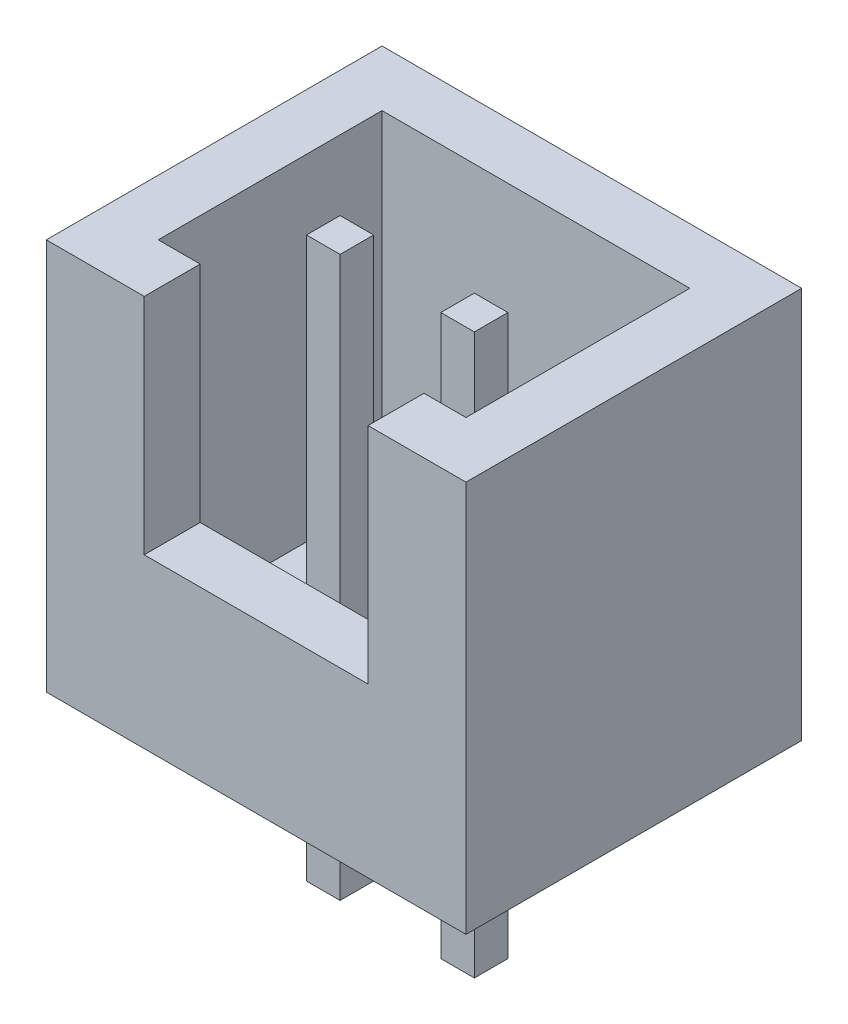
ISO-10303-21;
HEADER;
FILE_DESCRIPTION(('STEP AP214'),'2;1');
FILE_NAME('part.step','',(''),(''),'','','');
FILE_SCHEMA(('AUTOMOTIVE_DESIGN { 1 0 10303 214 1 1 1 1 }'));
ENDSEC;
DATA;
#1=APPLICATION_CONTEXT('core data for automotive mechanical design processes');
#2=APPLICATION_PROTOCOL_DEFINITION('international standard','automotive_design',2000,#1);
#3=PRODUCT_CONTEXT('',#1,'mechanical');
#4=PRODUCT('Part','Part','',(#3));
#5=PRODUCT_RELATED_PRODUCT_CATEGORY('part','',(#4));
#6=PRODUCT_DEFINITION_FORMATION('','',#4);
#7=PRODUCT_DEFINITION_CONTEXT('part definition',#1,'design');
#8=PRODUCT_DEFINITION('design','',#6,#7);
#9=PRODUCT_DEFINITION_SHAPE('','',#8);
#10=(LENGTH_UNIT() NAMED_UNIT(*) SI_UNIT(.MILLI.,.METRE.));
#11=(NAMED_UNIT(*) PLANE_ANGLE_UNIT() SI_UNIT($,.RADIAN.));
#12=(NAMED_UNIT(*) SI_UNIT($,.STERADIAN.) SOLID_ANGLE_UNIT());
#13=UNCERTAINTY_MEASURE_WITH_UNIT(LENGTH_MEASURE(1.E-05),#10,'distance_accuracy_value','');
#14=(GEOMETRIC_REPRESENTATION_CONTEXT(3) GLOBAL_UNCERTAINTY_ASSIGNED_CONTEXT((#13)) GLOBAL_UNIT_ASSIGNED_CONTEXT((#10,
#11,#12)) REPRESENTATION_CONTEXT('',''));
#15=CARTESIAN_POINT('',(0.,0.,0.));
#16=DIRECTION('',(0.,0.,1.));
#17=DIRECTION('',(1.,0.,0.));
#18=AXIS2_PLACEMENT_3D('',#15,#16,#17);
#19=CARTESIAN_POINT('',(3.75,7.,-3.));
#20=DIRECTION('',(-1.,0.,0.));
#21=DIRECTION('',(0.,0.,1.));
#22=AXIS2_PLACEMENT_3D('',#19,#20,#21);
#23=PLANE('',#22);
#24=DIRECTION('',(0.,0.,-1.));
#25=VECTOR('',#24,1.);
#26=CARTESIAN_POINT('',(3.75,0.,-3.));
#27=LINE('',#26,#25);
#28=CARTESIAN_POINT('',(3.75,0.,3.));
#29=VERTEX_POINT('',#28);
#30=CARTESIAN_POINT('',(3.75,0.,-3.));
#31=VERTEX_POINT('',#30);
#32=EDGE_CURVE('E359',#29,#31,#27,.T.);
#33=ORIENTED_EDGE('',*,*,#32,.T.);
#34=DIRECTION('',(0.,-1.,0.));
#35=VECTOR('',#34,1.);
#36=CARTESIAN_POINT('',(3.75,7.,-3.));
#37=LINE('',#36,#35);
#38=CARTESIAN_POINT('',(3.75,7.,-3.));
#39=VERTEX_POINT('',#38);
#40=EDGE_CURVE('E413',#39,#31,#37,.T.);
#41=ORIENTED_EDGE('',*,*,#40,.F.);
#42=DIRECTION('',(0.,0.,-1.));
#43=VECTOR('',#42,1.);
#44=CARTESIAN_POINT('',(3.75,7.,-3.));
#45=LINE('',#44,#43);
#46=CARTESIAN_POINT('',(3.75,7.,3.));
#47=VERTEX_POINT('',#46);
#48=EDGE_CURVE('E385',#47,#39,#45,.T.);
#49=ORIENTED_EDGE('',*,*,#48,.F.);
#50=DIRECTION('',(0.,-1.,0.));
#51=VECTOR('',#50,1.);
#52=CARTESIAN_POINT('',(3.75,7.,3.));
#53=LINE('',#52,#51);
#54=EDGE_CURVE('E397',#47,#29,#53,.T.);
#55=ORIENTED_EDGE('',*,*,#54,.T.);
#56=EDGE_LOOP('',(#33,#41,#49,#55));
#57=FACE_BOUND('',#56,.T.);
#58=ADVANCED_FACE('F37',(#57),#23,.F.);
#59=CARTESIAN_POINT('',(-3.75,7.,-3.));
#60=DIRECTION('',(0.,0.,1.));
#61=DIRECTION('',(1.,0.,0.));
#62=AXIS2_PLACEMENT_3D('',#59,#60,#61);
#63=PLANE('',#62);
#64=DIRECTION('',(-1.,0.,0.));
#65=VECTOR('',#64,1.);
#66=CARTESIAN_POINT('',(-3.75,0.,-3.));
#67=LINE('',#66,#65);
#68=CARTESIAN_POINT('',(-3.75,0.,-3.));
#69=VERTEX_POINT('',#68);
#70=EDGE_CURVE('E400',#31,#69,#67,.T.);
#71=ORIENTED_EDGE('',*,*,#70,.T.);
#72=DIRECTION('',(0.,-1.,0.));
#73=VECTOR('',#72,1.);
#74=CARTESIAN_POINT('',(-3.75,7.,-3.));
#75=LINE('',#74,#73);
#76=CARTESIAN_POINT('',(-3.75,7.,-3.));
#77=VERTEX_POINT('',#76);
#78=EDGE_CURVE('E410',#77,#69,#75,.T.);
#79=ORIENTED_EDGE('',*,*,#78,.F.);
#80=DIRECTION('',(-1.,0.,0.));
#81=VECTOR('',#80,1.);
#82=CARTESIAN_POINT('',(-3.75,7.,-3.));
#83=LINE('',#82,#81);
#84=EDGE_CURVE('E388',#39,#77,#83,.T.);
#85=ORIENTED_EDGE('',*,*,#84,.F.);
#86=ORIENTED_EDGE('',*,*,#40,.T.);
#87=EDGE_LOOP('',(#71,#79,#85,#86));
#88=FACE_BOUND('',#87,.T.);
#89=ADVANCED_FACE('F466',(#88),#63,.F.);
#90=CARTESIAN_POINT('',(-3.75,7.,-3.));
#91=DIRECTION('',(1.,0.,0.));
#92=DIRECTION('',(0.,0.,-1.));
#93=AXIS2_PLACEMENT_3D('',#90,#91,#92);
#94=PLANE('',#93);
#95=DIRECTION('',(0.,0.,1.));
#96=VECTOR('',#95,1.);
#97=CARTESIAN_POINT('',(-3.75,0.,-3.));
#98=LINE('',#97,#96);
#99=CARTESIAN_POINT('',(-3.75,0.,3.));
#100=VERTEX_POINT('',#99);
#101=EDGE_CURVE('E402',#69,#100,#98,.T.);
#102=ORIENTED_EDGE('',*,*,#101,.T.);
#103=DIRECTION('',(0.,-1.,0.));
#104=VECTOR('',#103,1.);
#105=CARTESIAN_POINT('',(-3.75,7.,3.));
#106=LINE('',#105,#104);
#107=CARTESIAN_POINT('',(-3.75,7.,3.));
#108=VERTEX_POINT('',#107);
#109=EDGE_CURVE('E407',#108,#100,#106,.T.);
#110=ORIENTED_EDGE('',*,*,#109,.F.);
#111=DIRECTION('',(0.,0.,1.));
#112=VECTOR('',#111,1.);
#113=CARTESIAN_POINT('',(-3.75,7.,-3.));
#114=LINE('',#113,#112);
#115=EDGE_CURVE('E391',#77,#108,#114,.T.);
#116=ORIENTED_EDGE('',*,*,#115,.F.);
#117=ORIENTED_EDGE('',*,*,#78,.T.);
#118=EDGE_LOOP('',(#102,#110,#116,#117));
#119=FACE_BOUND('',#118,.T.);
#120=ADVANCED_FACE('F471',(#119),#94,.F.);
#121=CARTESIAN_POINT('',(-3.75,7.,3.));
#122=DIRECTION('',(0.,0.,-1.));
#123=DIRECTION('',(-1.,0.,0.));
#124=AXIS2_PLACEMENT_3D('',#121,#122,#123);
#125=PLANE('',#124);
#126=DIRECTION('',(1.,0.,0.));
#127=VECTOR('',#126,1.);
#128=CARTESIAN_POINT('',(-3.75,7.,3.));
#129=LINE('',#128,#127);
#130=CARTESIAN_POINT('',(2.,7.,3.));
#131=VERTEX_POINT('',#130);
#132=EDGE_CURVE('E393',#131,#47,#129,.T.);
#133=ORIENTED_EDGE('',*,*,#132,.F.);
#134=DIRECTION('',(0.,1.,0.));
#135=VECTOR('',#134,1.);
#136=CARTESIAN_POINT('',(2.,7.,3.));
#137=LINE('',#136,#135);
#138=CARTESIAN_POINT('',(2.,3.,3.));
#139=VERTEX_POINT('',#138);
#140=EDGE_CURVE('E338',#139,#131,#137,.T.);
#141=ORIENTED_EDGE('',*,*,#140,.F.);
#142=DIRECTION('',(1.,0.,0.));
#143=VECTOR('',#142,1.);
#144=CARTESIAN_POINT('',(-2.,3.,3.));
#145=LINE('',#144,#143);
#146=CARTESIAN_POINT('',(-2.,3.,3.));
#147=VERTEX_POINT('',#146);
#148=EDGE_CURVE('E335',#147,#139,#145,.T.);
#149=ORIENTED_EDGE('',*,*,#148,.F.);
#150=DIRECTION('',(0.,-1.,0.));
#151=VECTOR('',#150,1.);
#152=CARTESIAN_POINT('',(-2.,7.,3.));
#153=LINE('',#152,#151);
#154=CARTESIAN_POINT('',(-2.,7.,3.));
#155=VERTEX_POINT('',#154);
#156=EDGE_CURVE('E332',#155,#147,#153,.T.);
#157=ORIENTED_EDGE('',*,*,#156,.F.);
#158=EDGE_CURVE('E394',#108,#155,#129,.T.);
#159=ORIENTED_EDGE('',*,*,#158,.F.);
#160=ORIENTED_EDGE('',*,*,#109,.T.);
#161=DIRECTION('',(1.,0.,0.));
#162=VECTOR('',#161,1.);
#163=CARTESIAN_POINT('',(-3.75,0.,3.));
#164=LINE('',#163,#162);
#165=EDGE_CURVE('E389',#100,#29,#164,.T.);
#166=ORIENTED_EDGE('',*,*,#165,.T.);
#167=ORIENTED_EDGE('',*,*,#54,.F.);
#168=EDGE_LOOP('',(#133,#141,#149,#157,#159,#160,#166,#167));
#169=FACE_BOUND('',#168,.T.);
#170=ADVANCED_FACE('F489',(#169),#125,.F.);
#171=CARTESIAN_POINT('',(0.,7.,0.));
#172=DIRECTION('',(0.,1.,0.));
#173=DIRECTION('',(0.,0.,1.));
#174=AXIS2_PLACEMENT_3D('',#171,#172,#173);
#175=PLANE('',#174);
#176=DIRECTION('',(0.,0.,1.));
#177=VECTOR('',#176,1.);
#178=CARTESIAN_POINT('',(2.,7.,-3.001));
#179=LINE('',#178,#177);
#180=CARTESIAN_POINT('',(2.,7.,2.));
#181=VERTEX_POINT('',#180);
#182=EDGE_CURVE('E344',#181,#131,#179,.T.);
#183=ORIENTED_EDGE('',*,*,#182,.T.);
#184=ORIENTED_EDGE('',*,*,#132,.T.);
#185=ORIENTED_EDGE('',*,*,#48,.T.);
#186=ORIENTED_EDGE('',*,*,#84,.T.);
#187=ORIENTED_EDGE('',*,*,#115,.T.);
#188=ORIENTED_EDGE('',*,*,#158,.T.);
#189=DIRECTION('',(0.,0.,1.));
#190=VECTOR('',#189,1.);
#191=CARTESIAN_POINT('',(-2.,7.,-3.001));
#192=LINE('',#191,#190);
#193=CARTESIAN_POINT('',(-2.,7.,2.));
#194=VERTEX_POINT('',#193);
#195=EDGE_CURVE('E341',#194,#155,#192,.T.);
#196=ORIENTED_EDGE('',*,*,#195,.F.);
#197=DIRECTION('',(1.,0.,0.));
#198=VECTOR('',#197,1.);
#199=CARTESIAN_POINT('',(-3.75,7.,2.));
#200=LINE('',#199,#198);
#201=CARTESIAN_POINT('',(-2.75,7.,2.));
#202=VERTEX_POINT('',#201);
#203=EDGE_CURVE('E365',#202,#194,#200,.T.);
#204=ORIENTED_EDGE('',*,*,#203,.F.);
#205=DIRECTION('',(0.,0.,1.));
#206=VECTOR('',#205,1.);
#207=CARTESIAN_POINT('',(-2.75,7.,-3.));
#208=LINE('',#207,#206);
#209=CARTESIAN_POINT('',(-2.75,7.,-2.));
#210=VERTEX_POINT('',#209);
#211=EDGE_CURVE('E379',#210,#202,#208,.T.);
#212=ORIENTED_EDGE('',*,*,#211,.F.);
#213=DIRECTION('',(-1.,0.,0.));
#214=VECTOR('',#213,1.);
#215=CARTESIAN_POINT('',(-3.75,7.,-2.));
#216=LINE('',#215,#214);
#217=CARTESIAN_POINT('',(2.75,7.,-2.));
#218=VERTEX_POINT('',#217);
#219=EDGE_CURVE('E377',#218,#210,#216,.T.);
#220=ORIENTED_EDGE('',*,*,#219,.F.);
#221=DIRECTION('',(0.,0.,-1.));
#222=VECTOR('',#221,1.);
#223=CARTESIAN_POINT('',(2.75,7.,-3.));
#224=LINE('',#223,#222);
#225=CARTESIAN_POINT('',(2.75,7.,2.));
#226=VERTEX_POINT('',#225);
#227=EDGE_CURVE('E375',#226,#218,#224,.T.);
#228=ORIENTED_EDGE('',*,*,#227,.F.);
#229=EDGE_CURVE('E382',#181,#226,#200,.T.);
#230=ORIENTED_EDGE('',*,*,#229,.F.);
#231=EDGE_LOOP('',(#183,#184,#185,#186,#187,#188,#196,#204,#212,#220,#228,#230));
#232=FACE_BOUND('',#231,.T.);
#233=ADVANCED_FACE('F484',(#232),#175,.T.);
#234=CARTESIAN_POINT('',(0.,0.,0.));
#235=DIRECTION('',(0.,1.,0.));
#236=DIRECTION('',(0.,0.,1.));
#237=AXIS2_PLACEMENT_3D('',#234,#235,#236);
#238=PLANE('',#237);
#239=DIRECTION('',(-1.,0.,0.));
#240=VECTOR('',#239,1.);
#241=CARTESIAN_POINT('',(0.,0.,0.));
#242=LINE('',#241,#240);
#243=CARTESIAN_POINT('',(1.5,0.,0.));
#244=VERTEX_POINT('',#243);
#245=CARTESIAN_POINT('',(0.9,0.,0.));
#246=VERTEX_POINT('',#245);
#247=EDGE_CURVE('E270',#244,#246,#242,.T.);
#248=ORIENTED_EDGE('',*,*,#247,.T.);
#249=DIRECTION('',(0.,0.,1.));
#250=VECTOR('',#249,1.);
#251=CARTESIAN_POINT('',(0.9,0.,0.));
#252=LINE('',#251,#250);
#253=CARTESIAN_POINT('',(0.9,0.,0.599999999999999));
#254=VERTEX_POINT('',#253);
#255=EDGE_CURVE('E273',#246,#254,#252,.T.);
#256=ORIENTED_EDGE('',*,*,#255,.T.);
#257=DIRECTION('',(1.,0.,0.));
#258=VECTOR('',#257,1.);
#259=CARTESIAN_POINT('',(0.,0.,0.599999999999999));
#260=LINE('',#259,#258);
#261=CARTESIAN_POINT('',(1.5,0.,0.599999999999999));
#262=VERTEX_POINT('',#261);
#263=EDGE_CURVE('E222',#254,#262,#260,.T.);
#264=ORIENTED_EDGE('',*,*,#263,.T.);
#265=DIRECTION('',(0.,0.,-1.));
#266=VECTOR('',#265,1.);
#267=CARTESIAN_POINT('',(1.5,0.,0.));
#268=LINE('',#267,#266);
#269=EDGE_CURVE('E267',#262,#244,#268,.T.);
#270=ORIENTED_EDGE('',*,*,#269,.T.);
#271=EDGE_LOOP('',(#248,#256,#264,#270));
#272=FACE_BOUND('',#271,.T.);
#273=DIRECTION('',(-1.,0.,0.));
#274=VECTOR('',#273,1.);
#275=CARTESIAN_POINT('',(0.,0.,0.));
#276=LINE('',#275,#274);
#277=CARTESIAN_POINT('',(-0.9,0.,0.));
#278=VERTEX_POINT('',#277);
#279=CARTESIAN_POINT('',(-1.5,0.,0.));
#280=VERTEX_POINT('',#279);
#281=EDGE_CURVE('E320',#278,#280,#276,.T.);
#282=ORIENTED_EDGE('',*,*,#281,.T.);
#283=DIRECTION('',(0.,0.,1.));
#284=VECTOR('',#283,1.);
#285=CARTESIAN_POINT('',(-1.5,0.,0.));
#286=LINE('',#285,#284);
#287=CARTESIAN_POINT('',(-1.5,0.,0.599999999999999));
#288=VERTEX_POINT('',#287);
#289=EDGE_CURVE('E323',#280,#288,#286,.T.);
#290=ORIENTED_EDGE('',*,*,#289,.T.);
#291=DIRECTION('',(1.,0.,0.));
#292=VECTOR('',#291,1.);
#293=CARTESIAN_POINT('',(0.,0.,0.599999999999999));
#294=LINE('',#293,#292);
#295=CARTESIAN_POINT('',(-0.9,0.,0.599999999999999));
#296=VERTEX_POINT('',#295);
#297=EDGE_CURVE('E303',#288,#296,#294,.T.);
#298=ORIENTED_EDGE('',*,*,#297,.T.);
#299=DIRECTION('',(0.,0.,-1.));
#300=VECTOR('',#299,1.);
#301=CARTESIAN_POINT('',(-0.9,0.,0.));
#302=LINE('',#301,#300);
#303=EDGE_CURVE('E317',#296,#278,#302,.T.);
#304=ORIENTED_EDGE('',*,*,#303,.T.);
#305=EDGE_LOOP('',(#282,#290,#298,#304));
#306=FACE_BOUND('',#305,.T.);
#307=ORIENTED_EDGE('',*,*,#32,.F.);
#308=ORIENTED_EDGE('',*,*,#165,.F.);
#309=ORIENTED_EDGE('',*,*,#101,.F.);
#310=ORIENTED_EDGE('',*,*,#70,.F.);
#311=EDGE_LOOP('',(#307,#308,#309,#310));
#312=FACE_BOUND('',#311,.T.);
#313=ADVANCED_FACE('F479',(#272,#306,#312),#238,.F.);
#314=CARTESIAN_POINT('',(2.75,7.,-3.));
#315=DIRECTION('',(-1.,0.,0.));
#316=DIRECTION('',(0.,0.,1.));
#317=AXIS2_PLACEMENT_3D('',#314,#315,#316);
#318=PLANE('',#317);
#319=DIRECTION('',(0.,0.,-1.));
#320=VECTOR('',#319,1.);
#321=CARTESIAN_POINT('',(2.75,1.,-3.));
#322=LINE('',#321,#320);
#323=CARTESIAN_POINT('',(2.75,1.,2.));
#324=VERTEX_POINT('',#323);
#325=CARTESIAN_POINT('',(2.75,1.,-2.));
#326=VERTEX_POINT('',#325);
#327=EDGE_CURVE('E352',#324,#326,#322,.T.);
#328=ORIENTED_EDGE('',*,*,#327,.F.);
#329=DIRECTION('',(0.,-1.,0.));
#330=VECTOR('',#329,1.);
#331=CARTESIAN_POINT('',(2.75,7.,2.));
#332=LINE('',#331,#330);
#333=EDGE_CURVE('E361',#226,#324,#332,.T.);
#334=ORIENTED_EDGE('',*,*,#333,.F.);
#335=ORIENTED_EDGE('',*,*,#227,.T.);
#336=DIRECTION('',(0.,-1.,0.));
#337=VECTOR('',#336,1.);
#338=CARTESIAN_POINT('',(2.75,7.,-2.));
#339=LINE('',#338,#337);
#340=EDGE_CURVE('E356',#218,#326,#339,.T.);
#341=ORIENTED_EDGE('',*,*,#340,.T.);
#342=EDGE_LOOP('',(#328,#334,#335,#341));
#343=FACE_BOUND('',#342,.T.);
#344=ADVANCED_FACE('F512',(#343),#318,.T.);
#345=CARTESIAN_POINT('',(-3.75,7.,-2.));
#346=DIRECTION('',(0.,0.,1.));
#347=DIRECTION('',(1.,0.,0.));
#348=AXIS2_PLACEMENT_3D('',#345,#346,#347);
#349=PLANE('',#348);
#350=DIRECTION('',(-1.,0.,0.));
#351=VECTOR('',#350,1.);
#352=CARTESIAN_POINT('',(-3.75,1.,-2.));
#353=LINE('',#352,#351);
#354=CARTESIAN_POINT('',(-2.75,1.,-2.));
#355=VERTEX_POINT('',#354);
#356=EDGE_CURVE('E355',#326,#355,#353,.T.);
#357=ORIENTED_EDGE('',*,*,#356,.F.);
#358=ORIENTED_EDGE('',*,*,#340,.F.);
#359=ORIENTED_EDGE('',*,*,#219,.T.);
#360=DIRECTION('',(0.,-1.,0.));
#361=VECTOR('',#360,1.);
#362=CARTESIAN_POINT('',(-2.75,7.,-2.));
#363=LINE('',#362,#361);
#364=EDGE_CURVE('E360',#210,#355,#363,.T.);
#365=ORIENTED_EDGE('',*,*,#364,.T.);
#366=EDGE_LOOP('',(#357,#358,#359,#365));
#367=FACE_BOUND('',#366,.T.);
#368=ADVANCED_FACE('F509',(#367),#349,.T.);
#369=CARTESIAN_POINT('',(-2.75,7.,-3.));
#370=DIRECTION('',(1.,0.,0.));
#371=DIRECTION('',(0.,0.,-1.));
#372=AXIS2_PLACEMENT_3D('',#369,#370,#371);
#373=PLANE('',#372);
#374=DIRECTION('',(0.,0.,1.));
#375=VECTOR('',#374,1.);
#376=CARTESIAN_POINT('',(-2.75,1.,-3.));
#377=LINE('',#376,#375);
#378=CARTESIAN_POINT('',(-2.75,1.,2.));
#379=VERTEX_POINT('',#378);
#380=EDGE_CURVE('E367',#355,#379,#377,.T.);
#381=ORIENTED_EDGE('',*,*,#380,.F.);
#382=ORIENTED_EDGE('',*,*,#364,.F.);
#383=ORIENTED_EDGE('',*,*,#211,.T.);
#384=DIRECTION('',(0.,-1.,0.));
#385=VECTOR('',#384,1.);
#386=CARTESIAN_POINT('',(-2.75,7.,2.));
#387=LINE('',#386,#385);
#388=EDGE_CURVE('E364',#202,#379,#387,.T.);
#389=ORIENTED_EDGE('',*,*,#388,.T.);
#390=EDGE_LOOP('',(#381,#382,#383,#389));
#391=FACE_BOUND('',#390,.T.);
#392=ADVANCED_FACE('F504',(#391),#373,.T.);
#393=CARTESIAN_POINT('',(-3.75,7.,2.));
#394=DIRECTION('',(0.,0.,-1.));
#395=DIRECTION('',(-1.,0.,0.));
#396=AXIS2_PLACEMENT_3D('',#393,#394,#395);
#397=PLANE('',#396);
#398=DIRECTION('',(0.,1.,0.));
#399=VECTOR('',#398,1.);
#400=CARTESIAN_POINT('',(2.,7.,2.));
#401=LINE('',#400,#399);
#402=CARTESIAN_POINT('',(2.,3.,2.));
#403=VERTEX_POINT('',#402);
#404=EDGE_CURVE('E326',#403,#181,#401,.T.);
#405=ORIENTED_EDGE('',*,*,#404,.T.);
#406=ORIENTED_EDGE('',*,*,#229,.T.);
#407=ORIENTED_EDGE('',*,*,#333,.T.);
#408=DIRECTION('',(1.,0.,0.));
#409=VECTOR('',#408,1.);
#410=CARTESIAN_POINT('',(-3.75,1.,2.));
#411=LINE('',#410,#409);
#412=EDGE_CURVE('E371',#379,#324,#411,.T.);
#413=ORIENTED_EDGE('',*,*,#412,.F.);
#414=ORIENTED_EDGE('',*,*,#388,.F.);
#415=ORIENTED_EDGE('',*,*,#203,.T.);
#416=DIRECTION('',(0.,-1.,0.));
#417=VECTOR('',#416,1.);
#418=CARTESIAN_POINT('',(-2.,7.,2.));
#419=LINE('',#418,#417);
#420=CARTESIAN_POINT('',(-2.,3.,2.));
#421=VERTEX_POINT('',#420);
#422=EDGE_CURVE('E329',#194,#421,#419,.T.);
#423=ORIENTED_EDGE('',*,*,#422,.T.);
#424=DIRECTION('',(1.,0.,0.));
#425=VECTOR('',#424,1.);
#426=CARTESIAN_POINT('',(-2.,3.,2.));
#427=LINE('',#426,#425);
#428=EDGE_CURVE('E343',#421,#403,#427,.T.);
#429=ORIENTED_EDGE('',*,*,#428,.T.);
#430=EDGE_LOOP('',(#405,#406,#407,#413,#414,#415,#423,#429));
#431=FACE_BOUND('',#430,.T.);
#432=ADVANCED_FACE('F499',(#431),#397,.T.);
#433=CARTESIAN_POINT('',(0.,1.,0.));
#434=DIRECTION('',(0.,1.,0.));
#435=DIRECTION('',(0.,0.,1.));
#436=AXIS2_PLACEMENT_3D('',#433,#434,#435);
#437=PLANE('',#436);
#438=DIRECTION('',(0.,0.,1.));
#439=VECTOR('',#438,1.);
#440=CARTESIAN_POINT('',(0.9,1.,0.));
#441=LINE('',#440,#439);
#442=CARTESIAN_POINT('',(0.9,1.,0.));
#443=VERTEX_POINT('',#442);
#444=CARTESIAN_POINT('',(0.9,1.,0.599999999999999));
#445=VERTEX_POINT('',#444);
#446=EDGE_CURVE('E11',#443,#445,#441,.T.);
#447=ORIENTED_EDGE('',*,*,#446,.F.);
#448=DIRECTION('',(-1.,0.,0.));
#449=VECTOR('',#448,1.);
#450=CARTESIAN_POINT('',(0.,1.,0.));
#451=LINE('',#450,#449);
#452=CARTESIAN_POINT('',(1.5,1.,0.));
#453=VERTEX_POINT('',#452);
#454=EDGE_CURVE('E44',#453,#443,#451,.T.);
#455=ORIENTED_EDGE('',*,*,#454,.F.);
#456=DIRECTION('',(0.,0.,-1.));
#457=VECTOR('',#456,1.);
#458=CARTESIAN_POINT('',(1.5,1.,0.));
#459=LINE('',#458,#457);
#460=CARTESIAN_POINT('',(1.5,1.,0.599999999999999));
#461=VERTEX_POINT('',#460);
#462=EDGE_CURVE('E431',#461,#453,#459,.T.);
#463=ORIENTED_EDGE('',*,*,#462,.F.);
#464=DIRECTION('',(1.,0.,0.));
#465=VECTOR('',#464,1.);
#466=CARTESIAN_POINT('',(0.,1.,0.599999999999999));
#467=LINE('',#466,#465);
#468=EDGE_CURVE('E428',#445,#461,#467,.T.);
#469=ORIENTED_EDGE('',*,*,#468,.F.);
#470=EDGE_LOOP('',(#447,#455,#463,#469));
#471=FACE_BOUND('',#470,.T.);
#472=DIRECTION('',(0.,0.,1.));
#473=VECTOR('',#472,1.);
#474=CARTESIAN_POINT('',(-1.5,1.,0.));
#475=LINE('',#474,#473);
#476=CARTESIAN_POINT('',(-1.5,1.,0.));
#477=VERTEX_POINT('',#476);
#478=CARTESIAN_POINT('',(-1.5,1.,0.599999999999999));
#479=VERTEX_POINT('',#478);
#480=EDGE_CURVE('E425',#477,#479,#475,.T.);
#481=ORIENTED_EDGE('',*,*,#480,.F.);
#482=DIRECTION('',(-1.,0.,0.));
#483=VECTOR('',#482,1.);
#484=CARTESIAN_POINT('',(0.,1.,0.));
#485=LINE('',#484,#483);
#486=CARTESIAN_POINT('',(-0.9,1.,0.));
#487=VERTEX_POINT('',#486);
#488=EDGE_CURVE('E422',#487,#477,#485,.T.);
#489=ORIENTED_EDGE('',*,*,#488,.F.);
#490=DIRECTION('',(0.,0.,-1.));
#491=VECTOR('',#490,1.);
#492=CARTESIAN_POINT('',(-0.9,1.,0.));
#493=LINE('',#492,#491);
#494=CARTESIAN_POINT('',(-0.9,1.,0.599999999999999));
#495=VERTEX_POINT('',#494);
#496=EDGE_CURVE('E419',#495,#487,#493,.T.);
#497=ORIENTED_EDGE('',*,*,#496,.F.);
#498=DIRECTION('',(1.,0.,0.));
#499=VECTOR('',#498,1.);
#500=CARTESIAN_POINT('',(0.,1.,0.599999999999999));
#501=LINE('',#500,#499);
#502=EDGE_CURVE('E416',#479,#495,#501,.T.);
#503=ORIENTED_EDGE('',*,*,#502,.F.);
#504=EDGE_LOOP('',(#481,#489,#497,#503));
#505=FACE_BOUND('',#504,.T.);
#506=ORIENTED_EDGE('',*,*,#327,.T.);
#507=ORIENTED_EDGE('',*,*,#356,.T.);
#508=ORIENTED_EDGE('',*,*,#380,.T.);
#509=ORIENTED_EDGE('',*,*,#412,.T.);
#510=EDGE_LOOP('',(#506,#507,#508,#509));
#511=FACE_BOUND('',#510,.T.);
#512=ADVANCED_FACE('F449',(#471,#505,#511),#437,.T.);
#513=CARTESIAN_POINT('',(-2.,3.,-3.001));
#514=DIRECTION('',(0.,-1.,0.));
#515=DIRECTION('',(1.,0.,0.));
#516=AXIS2_PLACEMENT_3D('',#513,#514,#515);
#517=PLANE('',#516);
#518=DIRECTION('',(0.,0.,1.));
#519=VECTOR('',#518,1.);
#520=CARTESIAN_POINT('',(-2.,3.,-3.001));
#521=LINE('',#520,#519);
#522=EDGE_CURVE('E340',#421,#147,#521,.T.);
#523=ORIENTED_EDGE('',*,*,#522,.T.);
#524=ORIENTED_EDGE('',*,*,#148,.T.);
#525=DIRECTION('',(0.,0.,1.));
#526=VECTOR('',#525,1.);
#527=CARTESIAN_POINT('',(2.,3.,-3.001));
#528=LINE('',#527,#526);
#529=EDGE_CURVE('E347',#403,#139,#528,.T.);
#530=ORIENTED_EDGE('',*,*,#529,.F.);
#531=ORIENTED_EDGE('',*,*,#428,.F.);
#532=EDGE_LOOP('',(#523,#524,#530,#531));
#533=FACE_BOUND('',#532,.T.);
#534=ADVANCED_FACE('F520',(#533),#517,.F.);
#535=CARTESIAN_POINT('',(2.,7.,-3.001));
#536=DIRECTION('',(1.,0.,0.));
#537=DIRECTION('',(0.,1.,0.));
#538=AXIS2_PLACEMENT_3D('',#535,#536,#537);
#539=PLANE('',#538);
#540=ORIENTED_EDGE('',*,*,#529,.T.);
#541=ORIENTED_EDGE('',*,*,#140,.T.);
#542=ORIENTED_EDGE('',*,*,#182,.F.);
#543=ORIENTED_EDGE('',*,*,#404,.F.);
#544=EDGE_LOOP('',(#540,#541,#542,#543));
#545=FACE_BOUND('',#544,.T.);
#546=ADVANCED_FACE('F518',(#545),#539,.F.);
#547=CARTESIAN_POINT('',(-2.,7.,-3.001));
#548=DIRECTION('',(-1.,0.,0.));
#549=DIRECTION('',(0.,-1.,0.));
#550=AXIS2_PLACEMENT_3D('',#547,#548,#549);
#551=PLANE('',#550);
#552=ORIENTED_EDGE('',*,*,#195,.T.);
#553=ORIENTED_EDGE('',*,*,#156,.T.);
#554=ORIENTED_EDGE('',*,*,#522,.F.);
#555=ORIENTED_EDGE('',*,*,#422,.F.);
#556=EDGE_LOOP('',(#552,#553,#554,#555));
#557=FACE_BOUND('',#556,.T.);
#558=ADVANCED_FACE('F522',(#557),#551,.F.);
#559=CARTESIAN_POINT('',(0.,7.,0.));
#560=DIRECTION('',(0.,1.,0.));
#561=DIRECTION('',(0.,0.,1.));
#562=AXIS2_PLACEMENT_3D('',#559,#560,#561);
#563=PLANE('',#562);
#564=DIRECTION('',(0.,0.,1.));
#565=VECTOR('',#564,1.);
#566=CARTESIAN_POINT('',(-1.5,7.,0.));
#567=LINE('',#566,#565);
#568=CARTESIAN_POINT('',(-1.5,7.,0.));
#569=VERTEX_POINT('',#568);
#570=CARTESIAN_POINT('',(-1.5,7.,0.599999999999999));
#571=VERTEX_POINT('',#570);
#572=EDGE_CURVE('E275',#569,#571,#567,.T.);
#573=ORIENTED_EDGE('',*,*,#572,.T.);
#574=DIRECTION('',(1.,0.,0.));
#575=VECTOR('',#574,1.);
#576=CARTESIAN_POINT('',(0.,7.,0.599999999999999));
#577=LINE('',#576,#575);
#578=CARTESIAN_POINT('',(-0.9,7.,0.599999999999999));
#579=VERTEX_POINT('',#578);
#580=EDGE_CURVE('E292',#571,#579,#577,.T.);
#581=ORIENTED_EDGE('',*,*,#580,.T.);
#582=DIRECTION('',(0.,0.,-1.));
#583=VECTOR('',#582,1.);
#584=CARTESIAN_POINT('',(-0.9,7.,0.));
#585=LINE('',#584,#583);
#586=CARTESIAN_POINT('',(-0.9,7.,0.));
#587=VERTEX_POINT('',#586);
#588=EDGE_CURVE('E295',#579,#587,#585,.T.);
#589=ORIENTED_EDGE('',*,*,#588,.T.);
#590=DIRECTION('',(-1.,0.,0.));
#591=VECTOR('',#590,1.);
#592=CARTESIAN_POINT('',(0.,7.,0.));
#593=LINE('',#592,#591);
#594=EDGE_CURVE('E280',#587,#569,#593,.T.);
#595=ORIENTED_EDGE('',*,*,#594,.T.);
#596=EDGE_LOOP('',(#573,#581,#589,#595));
#597=FACE_BOUND('',#596,.T.);
#598=ADVANCED_FACE('F524',(#597),#563,.T.);
#599=CARTESIAN_POINT('',(0.,-3.,0.599999999999999));
#600=DIRECTION('',(0.,0.,1.));
#601=DIRECTION('',(1.,0.,0.));
#602=AXIS2_PLACEMENT_3D('',#599,#600,#601);
#603=PLANE('',#602);
#604=DIRECTION('',(0.,1.,0.));
#605=VECTOR('',#604,1.);
#606=CARTESIAN_POINT('',(-1.5,-3.,0.599999999999999));
#607=LINE('',#606,#605);
#608=EDGE_CURVE('E289',#479,#571,#607,.T.);
#609=ORIENTED_EDGE('',*,*,#608,.F.);
#610=ORIENTED_EDGE('',*,*,#502,.T.);
#611=DIRECTION('',(0.,1.,0.));
#612=VECTOR('',#611,1.);
#613=CARTESIAN_POINT('',(-0.9,-3.,0.599999999999999));
#614=LINE('',#613,#612);
#615=EDGE_CURVE('E311',#495,#579,#614,.T.);
#616=ORIENTED_EDGE('',*,*,#615,.T.);
#617=ORIENTED_EDGE('',*,*,#580,.F.);
#618=EDGE_LOOP('',(#609,#610,#616,#617));
#619=FACE_BOUND('',#618,.T.);
#620=ADVANCED_FACE('F530',(#619),#603,.T.);
#621=CARTESIAN_POINT('',(-0.9,-3.,0.));
#622=DIRECTION('',(1.,0.,0.));
#623=DIRECTION('',(0.,0.,-1.));
#624=AXIS2_PLACEMENT_3D('',#621,#622,#623);
#625=PLANE('',#624);
#626=ORIENTED_EDGE('',*,*,#615,.F.);
#627=ORIENTED_EDGE('',*,*,#496,.T.);
#628=DIRECTION('',(0.,1.,0.));
#629=VECTOR('',#628,1.);
#630=CARTESIAN_POINT('',(-0.9,-3.,0.));
#631=LINE('',#630,#629);
#632=EDGE_CURVE('E308',#487,#587,#631,.T.);
#633=ORIENTED_EDGE('',*,*,#632,.T.);
#634=ORIENTED_EDGE('',*,*,#588,.F.);
#635=EDGE_LOOP('',(#626,#627,#633,#634));
#636=FACE_BOUND('',#635,.T.);
#637=ADVANCED_FACE('F628',(#636),#625,.T.);
#638=CARTESIAN_POINT('',(0.,-3.,0.));
#639=DIRECTION('',(0.,0.,-1.));
#640=DIRECTION('',(-1.,0.,0.));
#641=AXIS2_PLACEMENT_3D('',#638,#639,#640);
#642=PLANE('',#641);
#643=ORIENTED_EDGE('',*,*,#632,.F.);
#644=ORIENTED_EDGE('',*,*,#488,.T.);
#645=DIRECTION('',(0.,1.,0.));
#646=VECTOR('',#645,1.);
#647=CARTESIAN_POINT('',(-1.5,-3.,0.));
#648=LINE('',#647,#646);
#649=EDGE_CURVE('E304',#477,#569,#648,.T.);
#650=ORIENTED_EDGE('',*,*,#649,.T.);
#651=ORIENTED_EDGE('',*,*,#594,.F.);
#652=EDGE_LOOP('',(#643,#644,#650,#651));
#653=FACE_BOUND('',#652,.T.);
#654=ADVANCED_FACE('F638',(#653),#642,.T.);
#655=CARTESIAN_POINT('',(-1.5,-3.,0.));
#656=DIRECTION('',(-1.,0.,0.));
#657=DIRECTION('',(0.,0.,1.));
#658=AXIS2_PLACEMENT_3D('',#655,#656,#657);
#659=PLANE('',#658);
#660=ORIENTED_EDGE('',*,*,#649,.F.);
#661=ORIENTED_EDGE('',*,*,#480,.T.);
#662=ORIENTED_EDGE('',*,*,#608,.T.);
#663=ORIENTED_EDGE('',*,*,#572,.F.);
#664=EDGE_LOOP('',(#660,#661,#662,#663));
#665=FACE_BOUND('',#664,.T.);
#666=ADVANCED_FACE('F648',(#665),#659,.T.);
#667=ORIENTED_EDGE('',*,*,#289,.F.);
#668=CARTESIAN_POINT('',(-1.5,-3.,0.));
#669=VERTEX_POINT('',#668);
#670=EDGE_CURVE('E300',#669,#280,#648,.T.);
#671=ORIENTED_EDGE('',*,*,#670,.F.);
#672=DIRECTION('',(0.,0.,1.));
#673=VECTOR('',#672,1.);
#674=CARTESIAN_POINT('',(-1.5,-3.,0.));
#675=LINE('',#674,#673);
#676=CARTESIAN_POINT('',(-1.5,-3.,0.599999999999999));
#677=VERTEX_POINT('',#676);
#678=EDGE_CURVE('E276',#669,#677,#675,.T.);
#679=ORIENTED_EDGE('',*,*,#678,.T.);
#680=EDGE_CURVE('E312',#677,#288,#607,.T.);
#681=ORIENTED_EDGE('',*,*,#680,.T.);
#682=EDGE_LOOP('',(#667,#671,#679,#681));
#683=FACE_BOUND('',#682,.T.);
#684=ADVANCED_FACE('F658',(#683),#659,.T.);
#685=ORIENTED_EDGE('',*,*,#281,.F.);
#686=CARTESIAN_POINT('',(-0.9,-3.,0.));
#687=VERTEX_POINT('',#686);
#688=EDGE_CURVE('E305',#687,#278,#631,.T.);
#689=ORIENTED_EDGE('',*,*,#688,.F.);
#690=DIRECTION('',(-1.,0.,0.));
#691=VECTOR('',#690,1.);
#692=CARTESIAN_POINT('',(0.,-3.,0.));
#693=LINE('',#692,#691);
#694=EDGE_CURVE('E286',#687,#669,#693,.T.);
#695=ORIENTED_EDGE('',*,*,#694,.T.);
#696=ORIENTED_EDGE('',*,*,#670,.T.);
#697=EDGE_LOOP('',(#685,#689,#695,#696));
#698=FACE_BOUND('',#697,.T.);
#699=ADVANCED_FACE('F651',(#698),#642,.T.);
#700=ORIENTED_EDGE('',*,*,#303,.F.);
#701=CARTESIAN_POINT('',(-0.9,-3.,0.599999999999999));
#702=VERTEX_POINT('',#701);
#703=EDGE_CURVE('E309',#702,#296,#614,.T.);
#704=ORIENTED_EDGE('',*,*,#703,.F.);
#705=DIRECTION('',(0.,0.,-1.));
#706=VECTOR('',#705,1.);
#707=CARTESIAN_POINT('',(-0.9,-3.,0.));
#708=LINE('',#707,#706);
#709=EDGE_CURVE('E283',#702,#687,#708,.T.);
#710=ORIENTED_EDGE('',*,*,#709,.T.);
#711=ORIENTED_EDGE('',*,*,#688,.T.);
#712=EDGE_LOOP('',(#700,#704,#710,#711));
#713=FACE_BOUND('',#712,.T.);
#714=ADVANCED_FACE('F641',(#713),#625,.T.);
#715=ORIENTED_EDGE('',*,*,#297,.F.);
#716=ORIENTED_EDGE('',*,*,#680,.F.);
#717=DIRECTION('',(1.,0.,0.));
#718=VECTOR('',#717,1.);
#719=CARTESIAN_POINT('',(0.,-3.,0.599999999999999));
#720=LINE('',#719,#718);
#721=EDGE_CURVE('E279',#677,#702,#720,.T.);
#722=ORIENTED_EDGE('',*,*,#721,.T.);
#723=ORIENTED_EDGE('',*,*,#703,.T.);
#724=EDGE_LOOP('',(#715,#716,#722,#723));
#725=FACE_BOUND('',#724,.T.);
#726=ADVANCED_FACE('F631',(#725),#603,.T.);
#727=CARTESIAN_POINT('',(0.,-3.,0.));
#728=DIRECTION('',(0.,1.,0.));
#729=DIRECTION('',(0.,0.,1.));
#730=AXIS2_PLACEMENT_3D('',#727,#728,#729);
#731=PLANE('',#730);
#732=ORIENTED_EDGE('',*,*,#678,.F.);
#733=ORIENTED_EDGE('',*,*,#694,.F.);
#734=ORIENTED_EDGE('',*,*,#709,.F.);
#735=ORIENTED_EDGE('',*,*,#721,.F.);
#736=EDGE_LOOP('',(#732,#733,#734,#735));
#737=FACE_BOUND('',#736,.T.);
#738=ADVANCED_FACE('F461',(#737),#731,.F.);
#739=CARTESIAN_POINT('',(0.,7.,0.));
#740=DIRECTION('',(0.,1.,0.));
#741=DIRECTION('',(0.,0.,1.));
#742=AXIS2_PLACEMENT_3D('',#739,#740,#741);
#743=PLANE('',#742);
#744=DIRECTION('',(0.,0.,1.));
#745=VECTOR('',#744,1.);
#746=CARTESIAN_POINT('',(0.9,7.,0.));
#747=LINE('',#746,#745);
#748=CARTESIAN_POINT('',(0.9,7.,0.));
#749=VERTEX_POINT('',#748);
#750=CARTESIAN_POINT('',(0.9,7.,0.599999999999999));
#751=VERTEX_POINT('',#750);
#752=EDGE_CURVE('E251',#749,#751,#747,.T.);
#753=ORIENTED_EDGE('',*,*,#752,.T.);
#754=DIRECTION('',(1.,0.,0.));
#755=VECTOR('',#754,1.);
#756=CARTESIAN_POINT('',(0.,7.,0.599999999999999));
#757=LINE('',#756,#755);
#758=CARTESIAN_POINT('',(1.5,7.,0.599999999999999));
#759=VERTEX_POINT('',#758);
#760=EDGE_CURVE('E254',#751,#759,#757,.T.);
#761=ORIENTED_EDGE('',*,*,#760,.T.);
#762=DIRECTION('',(0.,0.,-1.));
#763=VECTOR('',#762,1.);
#764=CARTESIAN_POINT('',(1.5,7.,0.));
#765=LINE('',#764,#763);
#766=CARTESIAN_POINT('',(1.5,7.,0.));
#767=VERTEX_POINT('',#766);
#768=EDGE_CURVE('E245',#759,#767,#765,.T.);
#769=ORIENTED_EDGE('',*,*,#768,.T.);
#770=DIRECTION('',(-1.,0.,0.));
#771=VECTOR('',#770,1.);
#772=CARTESIAN_POINT('',(0.,7.,0.));
#773=LINE('',#772,#771);
#774=EDGE_CURVE('E242',#767,#749,#773,.T.);
#775=ORIENTED_EDGE('',*,*,#774,.T.);
#776=EDGE_LOOP('',(#753,#761,#769,#775));
#777=FACE_BOUND('',#776,.T.);
#778=ADVANCED_FACE('F444',(#777),#743,.T.);
#779=CARTESIAN_POINT('',(0.,-3.,0.599999999999999));
#780=DIRECTION('',(0.,0.,1.));
#781=DIRECTION('',(1.,0.,0.));
#782=AXIS2_PLACEMENT_3D('',#779,#780,#781);
#783=PLANE('',#782);
#784=DIRECTION('',(0.,1.,0.));
#785=VECTOR('',#784,1.);
#786=CARTESIAN_POINT('',(0.9,-3.,0.599999999999999));
#787=LINE('',#786,#785);
#788=EDGE_CURVE('E227',#445,#751,#787,.T.);
#789=ORIENTED_EDGE('',*,*,#788,.F.);
#790=ORIENTED_EDGE('',*,*,#468,.T.);
#791=DIRECTION('',(0.,1.,0.));
#792=VECTOR('',#791,1.);
#793=CARTESIAN_POINT('',(1.5,-3.,0.599999999999999));
#794=LINE('',#793,#792);
#795=EDGE_CURVE('E226',#461,#759,#794,.T.);
#796=ORIENTED_EDGE('',*,*,#795,.T.);
#797=ORIENTED_EDGE('',*,*,#760,.F.);
#798=EDGE_LOOP('',(#789,#790,#796,#797));
#799=FACE_BOUND('',#798,.T.);
#800=ADVANCED_FACE('F452',(#799),#783,.T.);
#801=CARTESIAN_POINT('',(1.5,-3.,0.));
#802=DIRECTION('',(1.,0.,0.));
#803=DIRECTION('',(0.,0.,-1.));
#804=AXIS2_PLACEMENT_3D('',#801,#802,#803);
#805=PLANE('',#804);
#806=ORIENTED_EDGE('',*,*,#795,.F.);
#807=ORIENTED_EDGE('',*,*,#462,.T.);
#808=DIRECTION('',(0.,1.,0.));
#809=VECTOR('',#808,1.);
#810=CARTESIAN_POINT('',(1.5,-3.,0.));
#811=LINE('',#810,#809);
#812=EDGE_CURVE('E264',#453,#767,#811,.T.);
#813=ORIENTED_EDGE('',*,*,#812,.T.);
#814=ORIENTED_EDGE('',*,*,#768,.F.);
#815=EDGE_LOOP('',(#806,#807,#813,#814));
#816=FACE_BOUND('',#815,.T.);
#817=ADVANCED_FACE('F448',(#816),#805,.T.);
#818=CARTESIAN_POINT('',(0.,-3.,0.));
#819=DIRECTION('',(0.,0.,-1.));
#820=DIRECTION('',(-1.,0.,0.));
#821=AXIS2_PLACEMENT_3D('',#818,#819,#820);
#822=PLANE('',#821);
#823=ORIENTED_EDGE('',*,*,#812,.F.);
#824=ORIENTED_EDGE('',*,*,#454,.T.);
#825=DIRECTION('',(0.,1.,0.));
#826=VECTOR('',#825,1.);
#827=CARTESIAN_POINT('',(0.9,-3.,0.));
#828=LINE('',#827,#826);
#829=EDGE_CURVE('E260',#443,#749,#828,.T.);
#830=ORIENTED_EDGE('',*,*,#829,.T.);
#831=ORIENTED_EDGE('',*,*,#774,.F.);
#832=EDGE_LOOP('',(#823,#824,#830,#831));
#833=FACE_BOUND('',#832,.T.);
#834=ADVANCED_FACE('F436',(#833),#822,.T.);
#835=CARTESIAN_POINT('',(0.9,-3.,0.));
#836=DIRECTION('',(-1.,0.,0.));
#837=DIRECTION('',(0.,0.,1.));
#838=AXIS2_PLACEMENT_3D('',#835,#836,#837);
#839=PLANE('',#838);
#840=ORIENTED_EDGE('',*,*,#829,.F.);
#841=ORIENTED_EDGE('',*,*,#446,.T.);
#842=ORIENTED_EDGE('',*,*,#788,.T.);
#843=ORIENTED_EDGE('',*,*,#752,.F.);
#844=EDGE_LOOP('',(#840,#841,#842,#843));
#845=FACE_BOUND('',#844,.T.);
#846=ADVANCED_FACE('F440',(#845),#839,.T.);
#847=ORIENTED_EDGE('',*,*,#255,.F.);
#848=CARTESIAN_POINT('',(0.9,-3.,0.));
#849=VERTEX_POINT('',#848);
#850=EDGE_CURVE('E241',#849,#246,#828,.T.);
#851=ORIENTED_EDGE('',*,*,#850,.F.);
#852=DIRECTION('',(0.,0.,1.));
#853=VECTOR('',#852,1.);
#854=CARTESIAN_POINT('',(0.9,-3.,0.));
#855=LINE('',#854,#853);
#856=CARTESIAN_POINT('',(0.9,-3.,0.599999999999999));
#857=VERTEX_POINT('',#856);
#858=EDGE_CURVE('E234',#849,#857,#855,.T.);
#859=ORIENTED_EDGE('',*,*,#858,.T.);
#860=EDGE_CURVE('E217',#857,#254,#787,.T.);
#861=ORIENTED_EDGE('',*,*,#860,.T.);
#862=EDGE_LOOP('',(#847,#851,#859,#861));
#863=FACE_BOUND('',#862,.T.);
#864=ADVANCED_FACE('F239',(#863),#839,.T.);
#865=ORIENTED_EDGE('',*,*,#247,.F.);
#866=CARTESIAN_POINT('',(1.5,-3.,0.));
#867=VERTEX_POINT('',#866);
#868=EDGE_CURVE('E261',#867,#244,#811,.T.);
#869=ORIENTED_EDGE('',*,*,#868,.F.);
#870=DIRECTION('',(-1.,0.,0.));
#871=VECTOR('',#870,1.);
#872=CARTESIAN_POINT('',(0.,-3.,0.));
#873=LINE('',#872,#871);
#874=EDGE_CURVE('E249',#867,#849,#873,.T.);
#875=ORIENTED_EDGE('',*,*,#874,.T.);
#876=ORIENTED_EDGE('',*,*,#850,.T.);
#877=EDGE_LOOP('',(#865,#869,#875,#876));
#878=FACE_BOUND('',#877,.T.);
#879=ADVANCED_FACE('F718',(#878),#822,.T.);
#880=ORIENTED_EDGE('',*,*,#269,.F.);
#881=CARTESIAN_POINT('',(1.5,-3.,0.599999999999999));
#882=VERTEX_POINT('',#881);
#883=EDGE_CURVE('E51',#882,#262,#794,.T.);
#884=ORIENTED_EDGE('',*,*,#883,.F.);
#885=DIRECTION('',(0.,0.,-1.));
#886=VECTOR('',#885,1.);
#887=CARTESIAN_POINT('',(1.5,-3.,0.));
#888=LINE('',#887,#886);
#889=EDGE_CURVE('E237',#882,#867,#888,.T.);
#890=ORIENTED_EDGE('',*,*,#889,.T.);
#891=ORIENTED_EDGE('',*,*,#868,.T.);
#892=EDGE_LOOP('',(#880,#884,#890,#891));
#893=FACE_BOUND('',#892,.T.);
#894=ADVANCED_FACE('F460',(#893),#805,.T.);
#895=ORIENTED_EDGE('',*,*,#263,.F.);
#896=ORIENTED_EDGE('',*,*,#860,.F.);
#897=DIRECTION('',(1.,0.,0.));
#898=VECTOR('',#897,1.);
#899=CARTESIAN_POINT('',(0.,-3.,0.599999999999999));
#900=LINE('',#899,#898);
#901=EDGE_CURVE('E220',#857,#882,#900,.T.);
#902=ORIENTED_EDGE('',*,*,#901,.T.);
#903=ORIENTED_EDGE('',*,*,#883,.T.);
#904=EDGE_LOOP('',(#895,#896,#902,#903));
#905=FACE_BOUND('',#904,.T.);
#906=ADVANCED_FACE('F219',(#905),#783,.T.);
#907=CARTESIAN_POINT('',(0.,-3.,0.));
#908=DIRECTION('',(0.,1.,0.));
#909=DIRECTION('',(0.,0.,1.));
#910=AXIS2_PLACEMENT_3D('',#907,#908,#909);
#911=PLANE('',#910);
#912=ORIENTED_EDGE('',*,*,#858,.F.);
#913=ORIENTED_EDGE('',*,*,#874,.F.);
#914=ORIENTED_EDGE('',*,*,#889,.F.);
#915=ORIENTED_EDGE('',*,*,#901,.F.);
#916=EDGE_LOOP('',(#912,#913,#914,#915));
#917=FACE_BOUND('',#916,.T.);
#918=ADVANCED_FACE('F232',(#917),#911,.F.);
#919=CLOSED_SHELL('',(#58,#89,#120,#170,#233,#313,#344,#368,#392,#432,#512,#534,#546,#558,#598,
#620,#637,#654,#666,#684,#699,#714,#726,#738,#778,#800,#817,#834,#846,#864,#879,#894,#906,#918));
#920=MANIFOLD_SOLID_BREP('B2',#919);
#921=ADVANCED_BREP_SHAPE_REPRESENTATION('',(#18,#920),#14);
#922=SHAPE_DEFINITION_REPRESENTATION(#9,#921);
ENDSEC;
END-ISO-10303-21;
